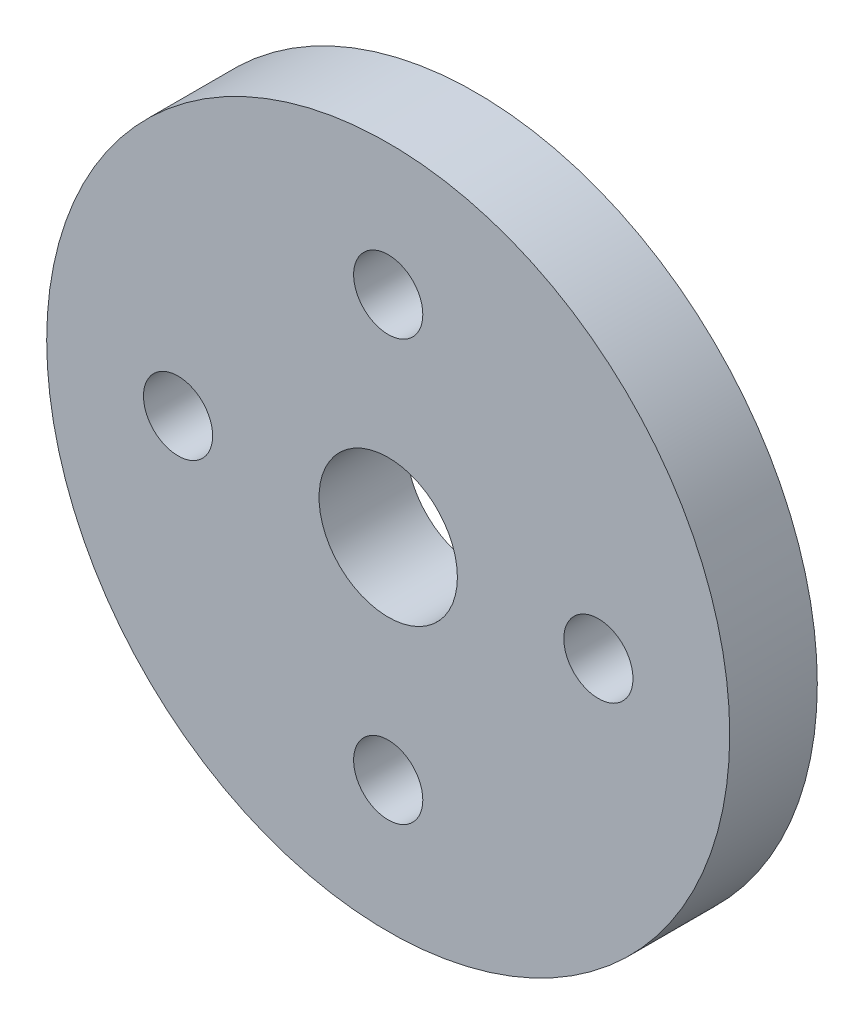
ISO-10303-21;
HEADER;
FILE_DESCRIPTION(('STEP AP214'),'2;1');
FILE_NAME('part.step','',(''),(''),'','','');
FILE_SCHEMA(('AUTOMOTIVE_DESIGN { 1 0 10303 214 1 1 1 1 }'));
ENDSEC;
DATA;
#1=APPLICATION_CONTEXT('core data for automotive mechanical design processes');
#2=APPLICATION_PROTOCOL_DEFINITION('international standard','automotive_design',2000,#1);
#3=PRODUCT_CONTEXT('',#1,'mechanical');
#4=PRODUCT('Part','Part','',(#3));
#5=PRODUCT_RELATED_PRODUCT_CATEGORY('part','',(#4));
#6=PRODUCT_DEFINITION_FORMATION('','',#4);
#7=PRODUCT_DEFINITION_CONTEXT('part definition',#1,'design');
#8=PRODUCT_DEFINITION('design','',#6,#7);
#9=PRODUCT_DEFINITION_SHAPE('','',#8);
#10=(LENGTH_UNIT() NAMED_UNIT(*) SI_UNIT(.MILLI.,.METRE.));
#11=(NAMED_UNIT(*) PLANE_ANGLE_UNIT() SI_UNIT($,.RADIAN.));
#12=(NAMED_UNIT(*) SI_UNIT($,.STERADIAN.) SOLID_ANGLE_UNIT());
#13=UNCERTAINTY_MEASURE_WITH_UNIT(LENGTH_MEASURE(1.E-05),#10,'distance_accuracy_value','');
#14=(GEOMETRIC_REPRESENTATION_CONTEXT(3) GLOBAL_UNCERTAINTY_ASSIGNED_CONTEXT((#13)) GLOBAL_UNIT_ASSIGNED_CONTEXT((#10,
#11,#12)) REPRESENTATION_CONTEXT('',''));
#15=CARTESIAN_POINT('',(0.,0.,0.));
#16=DIRECTION('',(0.,0.,1.));
#17=DIRECTION('',(1.,0.,0.));
#18=AXIS2_PLACEMENT_3D('',#15,#16,#17);
#19=CARTESIAN_POINT('',(0.,0.,5.));
#20=DIRECTION('',(0.,0.,1.));
#21=DIRECTION('',(1.,0.,0.));
#22=AXIS2_PLACEMENT_3D('',#19,#20,#21);
#23=PLANE('',#22);
#24=CARTESIAN_POINT('',(6.77712297852766E-13,-12.,5.));
#25=DIRECTION('',(0.,0.,1.));
#26=DIRECTION('',(1.,0.,0.));
#27=AXIS2_PLACEMENT_3D('',#24,#25,#26);
#28=CIRCLE('',#27,1.97500000000073);
#29=CARTESIAN_POINT('',(1.97500000000141,-12.,5.));
#30=VERTEX_POINT('',#29);
#31=EDGE_CURVE('E58',#30,#30,#28,.T.);
#32=ORIENTED_EDGE('',*,*,#31,.F.);
#33=EDGE_LOOP('',(#32));
#34=FACE_BOUND('',#33,.T.);
#35=CARTESIAN_POINT('',(0.,12.,5.));
#36=DIRECTION('',(0.,0.,1.));
#37=DIRECTION('',(1.,0.,0.));
#38=AXIS2_PLACEMENT_3D('',#35,#36,#37);
#39=CIRCLE('',#38,1.975);
#40=CARTESIAN_POINT('',(1.975,12.,5.));
#41=VERTEX_POINT('',#40);
#42=EDGE_CURVE('E46',#41,#41,#39,.T.);
#43=ORIENTED_EDGE('',*,*,#42,.F.);
#44=EDGE_LOOP('',(#43));
#45=FACE_BOUND('',#44,.T.);
#46=CARTESIAN_POINT('',(0.,0.,5.));
#47=DIRECTION('',(0.,0.,1.));
#48=DIRECTION('',(1.,0.,0.));
#49=AXIS2_PLACEMENT_3D('',#46,#47,#48);
#50=CIRCLE('',#49,19.5);
#51=CARTESIAN_POINT('',(19.5,0.,5.));
#52=VERTEX_POINT('',#51);
#53=EDGE_CURVE('E10',#52,#52,#50,.T.);
#54=ORIENTED_EDGE('',*,*,#53,.T.);
#55=EDGE_LOOP('',(#54));
#56=FACE_BOUND('',#55,.T.);
#57=CARTESIAN_POINT('',(0.,0.,5.));
#58=DIRECTION('',(0.,0.,1.));
#59=DIRECTION('',(1.,0.,0.));
#60=AXIS2_PLACEMENT_3D('',#57,#58,#59);
#61=CIRCLE('',#60,3.95);
#62=CARTESIAN_POINT('',(3.95,0.,5.));
#63=VERTEX_POINT('',#62);
#64=EDGE_CURVE('E41',#63,#63,#61,.T.);
#65=ORIENTED_EDGE('',*,*,#64,.F.);
#66=EDGE_LOOP('',(#65));
#67=FACE_BOUND('',#66,.T.);
#68=CARTESIAN_POINT('',(12.0000000000003,3.38856148926383E-13,5.));
#69=DIRECTION('',(0.,0.,1.));
#70=DIRECTION('',(1.,0.,0.));
#71=AXIS2_PLACEMENT_3D('',#68,#69,#70);
#72=CIRCLE('',#71,1.97500000000027);
#73=CARTESIAN_POINT('',(13.9750000000006,3.38856148926383E-13,5.));
#74=VERTEX_POINT('',#73);
#75=EDGE_CURVE('E52',#74,#74,#72,.T.);
#76=ORIENTED_EDGE('',*,*,#75,.F.);
#77=EDGE_LOOP('',(#76));
#78=FACE_BOUND('',#77,.T.);
#79=CARTESIAN_POINT('',(-11.9999999999997,-3.4032572508536E-13,5.));
#80=DIRECTION('',(0.,0.,1.));
#81=DIRECTION('',(1.,0.,0.));
#82=AXIS2_PLACEMENT_3D('',#79,#80,#81);
#83=CIRCLE('',#82,1.97500000000055);
#84=CARTESIAN_POINT('',(-10.0249999999991,-3.4032572508536E-13,5.));
#85=VERTEX_POINT('',#84);
#86=EDGE_CURVE('E64',#85,#85,#83,.T.);
#87=ORIENTED_EDGE('',*,*,#86,.F.);
#88=EDGE_LOOP('',(#87));
#89=FACE_BOUND('',#88,.T.);
#90=ADVANCED_FACE('F30',(#34,#45,#56,#67,#78,#89),#23,.T.);
#91=CARTESIAN_POINT('',(0.,0.,0.));
#92=DIRECTION('',(0.,0.,1.));
#93=DIRECTION('',(1.,0.,0.));
#94=AXIS2_PLACEMENT_3D('',#91,#92,#93);
#95=PLANE('',#94);
#96=CARTESIAN_POINT('',(0.,0.,0.));
#97=DIRECTION('',(0.,0.,1.));
#98=DIRECTION('',(1.,0.,0.));
#99=AXIS2_PLACEMENT_3D('',#96,#97,#98);
#100=CIRCLE('',#99,19.5);
#101=CARTESIAN_POINT('',(19.5,0.,0.));
#102=VERTEX_POINT('',#101);
#103=EDGE_CURVE('E34',#102,#102,#100,.T.);
#104=ORIENTED_EDGE('',*,*,#103,.F.);
#105=EDGE_LOOP('',(#104));
#106=FACE_BOUND('',#105,.T.);
#107=CARTESIAN_POINT('',(0.,0.,0.));
#108=DIRECTION('',(0.,0.,1.));
#109=DIRECTION('',(1.,0.,0.));
#110=AXIS2_PLACEMENT_3D('',#107,#108,#109);
#111=CIRCLE('',#110,3.95);
#112=CARTESIAN_POINT('',(3.95,0.,0.));
#113=VERTEX_POINT('',#112);
#114=EDGE_CURVE('E43',#113,#113,#111,.T.);
#115=ORIENTED_EDGE('',*,*,#114,.T.);
#116=EDGE_LOOP('',(#115));
#117=FACE_BOUND('',#116,.T.);
#118=CARTESIAN_POINT('',(0.,12.,0.));
#119=DIRECTION('',(0.,0.,1.));
#120=DIRECTION('',(1.,0.,0.));
#121=AXIS2_PLACEMENT_3D('',#118,#119,#120);
#122=CIRCLE('',#121,1.975);
#123=CARTESIAN_POINT('',(1.975,12.,0.));
#124=VERTEX_POINT('',#123);
#125=EDGE_CURVE('E49',#124,#124,#122,.T.);
#126=ORIENTED_EDGE('',*,*,#125,.T.);
#127=EDGE_LOOP('',(#126));
#128=FACE_BOUND('',#127,.T.);
#129=CARTESIAN_POINT('',(12.0000000000003,3.38856148926383E-13,0.));
#130=DIRECTION('',(0.,0.,1.));
#131=DIRECTION('',(1.,0.,0.));
#132=AXIS2_PLACEMENT_3D('',#129,#130,#131);
#133=CIRCLE('',#132,1.97500000000027);
#134=CARTESIAN_POINT('',(13.9750000000006,3.38856148926383E-13,0.));
#135=VERTEX_POINT('',#134);
#136=EDGE_CURVE('E55',#135,#135,#133,.T.);
#137=ORIENTED_EDGE('',*,*,#136,.T.);
#138=EDGE_LOOP('',(#137));
#139=FACE_BOUND('',#138,.T.);
#140=CARTESIAN_POINT('',(6.77712297852766E-13,-12.,0.));
#141=DIRECTION('',(0.,0.,1.));
#142=DIRECTION('',(1.,0.,0.));
#143=AXIS2_PLACEMENT_3D('',#140,#141,#142);
#144=CIRCLE('',#143,1.97500000000073);
#145=CARTESIAN_POINT('',(1.97500000000141,-12.,0.));
#146=VERTEX_POINT('',#145);
#147=EDGE_CURVE('E61',#146,#146,#144,.T.);
#148=ORIENTED_EDGE('',*,*,#147,.T.);
#149=EDGE_LOOP('',(#148));
#150=FACE_BOUND('',#149,.T.);
#151=CARTESIAN_POINT('',(-11.9999999999997,-3.4032572508536E-13,0.));
#152=DIRECTION('',(0.,0.,1.));
#153=DIRECTION('',(1.,0.,0.));
#154=AXIS2_PLACEMENT_3D('',#151,#152,#153);
#155=CIRCLE('',#154,1.97500000000055);
#156=CARTESIAN_POINT('',(-10.0249999999991,-3.4032572508536E-13,0.));
#157=VERTEX_POINT('',#156);
#158=EDGE_CURVE('E67',#157,#157,#155,.T.);
#159=ORIENTED_EDGE('',*,*,#158,.T.);
#160=EDGE_LOOP('',(#159));
#161=FACE_BOUND('',#160,.T.);
#162=ADVANCED_FACE('F77',(#106,#117,#128,#139,#150,#161),#95,.F.);
#163=CARTESIAN_POINT('',(0.,0.,5.));
#164=DIRECTION('',(0.,0.,-1.));
#165=DIRECTION('',(-1.,0.,0.));
#166=AXIS2_PLACEMENT_3D('',#163,#164,#165);
#167=CYLINDRICAL_SURFACE('',#166,19.5);
#168=ORIENTED_EDGE('',*,*,#53,.F.);
#169=EDGE_LOOP('',(#168));
#170=FACE_BOUND('',#169,.T.);
#171=ORIENTED_EDGE('',*,*,#103,.T.);
#172=EDGE_LOOP('',(#171));
#173=FACE_BOUND('',#172,.T.);
#174=ADVANCED_FACE('F32',(#170,#173),#167,.T.);
#175=CARTESIAN_POINT('',(0.,0.,5.));
#176=DIRECTION('',(0.,0.,-1.));
#177=DIRECTION('',(-1.,0.,0.));
#178=AXIS2_PLACEMENT_3D('',#175,#176,#177);
#179=CYLINDRICAL_SURFACE('',#178,3.95);
#180=ORIENTED_EDGE('',*,*,#64,.T.);
#181=EDGE_LOOP('',(#180));
#182=FACE_BOUND('',#181,.T.);
#183=ORIENTED_EDGE('',*,*,#114,.F.);
#184=EDGE_LOOP('',(#183));
#185=FACE_BOUND('',#184,.T.);
#186=ADVANCED_FACE('F87',(#182,#185),#179,.F.);
#187=CARTESIAN_POINT('',(0.,12.,5.));
#188=DIRECTION('',(0.,0.,-1.));
#189=DIRECTION('',(-1.,0.,0.));
#190=AXIS2_PLACEMENT_3D('',#187,#188,#189);
#191=CYLINDRICAL_SURFACE('',#190,1.975);
#192=ORIENTED_EDGE('',*,*,#42,.T.);
#193=EDGE_LOOP('',(#192));
#194=FACE_BOUND('',#193,.T.);
#195=ORIENTED_EDGE('',*,*,#125,.F.);
#196=EDGE_LOOP('',(#195));
#197=FACE_BOUND('',#196,.T.);
#198=ADVANCED_FACE('F90',(#194,#197),#191,.F.);
#199=CARTESIAN_POINT('',(12.0000000000003,3.38856148926383E-13,5.));
#200=DIRECTION('',(0.,0.,-1.));
#201=DIRECTION('',(-1.,0.,0.));
#202=AXIS2_PLACEMENT_3D('',#199,#200,#201);
#203=CYLINDRICAL_SURFACE('',#202,1.97500000000027);
#204=ORIENTED_EDGE('',*,*,#75,.T.);
#205=EDGE_LOOP('',(#204));
#206=FACE_BOUND('',#205,.T.);
#207=ORIENTED_EDGE('',*,*,#136,.F.);
#208=EDGE_LOOP('',(#207));
#209=FACE_BOUND('',#208,.T.);
#210=ADVANCED_FACE('F94',(#206,#209),#203,.F.);
#211=CARTESIAN_POINT('',(6.77712297852766E-13,-12.,5.));
#212=DIRECTION('',(0.,0.,-1.));
#213=DIRECTION('',(-1.,0.,0.));
#214=AXIS2_PLACEMENT_3D('',#211,#212,#213);
#215=CYLINDRICAL_SURFACE('',#214,1.97500000000073);
#216=ORIENTED_EDGE('',*,*,#31,.T.);
#217=EDGE_LOOP('',(#216));
#218=FACE_BOUND('',#217,.T.);
#219=ORIENTED_EDGE('',*,*,#147,.F.);
#220=EDGE_LOOP('',(#219));
#221=FACE_BOUND('',#220,.T.);
#222=ADVANCED_FACE('F98',(#218,#221),#215,.F.);
#223=CARTESIAN_POINT('',(-11.9999999999997,-3.4032572508536E-13,5.));
#224=DIRECTION('',(0.,0.,-1.));
#225=DIRECTION('',(-1.,0.,0.));
#226=AXIS2_PLACEMENT_3D('',#223,#224,#225);
#227=CYLINDRICAL_SURFACE('',#226,1.97500000000055);
#228=ORIENTED_EDGE('',*,*,#86,.T.);
#229=EDGE_LOOP('',(#228));
#230=FACE_BOUND('',#229,.T.);
#231=ORIENTED_EDGE('',*,*,#158,.F.);
#232=EDGE_LOOP('',(#231));
#233=FACE_BOUND('',#232,.T.);
#234=ADVANCED_FACE('F73',(#230,#233),#227,.F.);
#235=CLOSED_SHELL('',(#90,#162,#174,#186,#198,#210,#222,#234));
#236=MANIFOLD_SOLID_BREP('B2',#235);
#237=ADVANCED_BREP_SHAPE_REPRESENTATION('',(#18,#236),#14);
#238=SHAPE_DEFINITION_REPRESENTATION(#9,#237);
ENDSEC;
END-ISO-10303-21;
